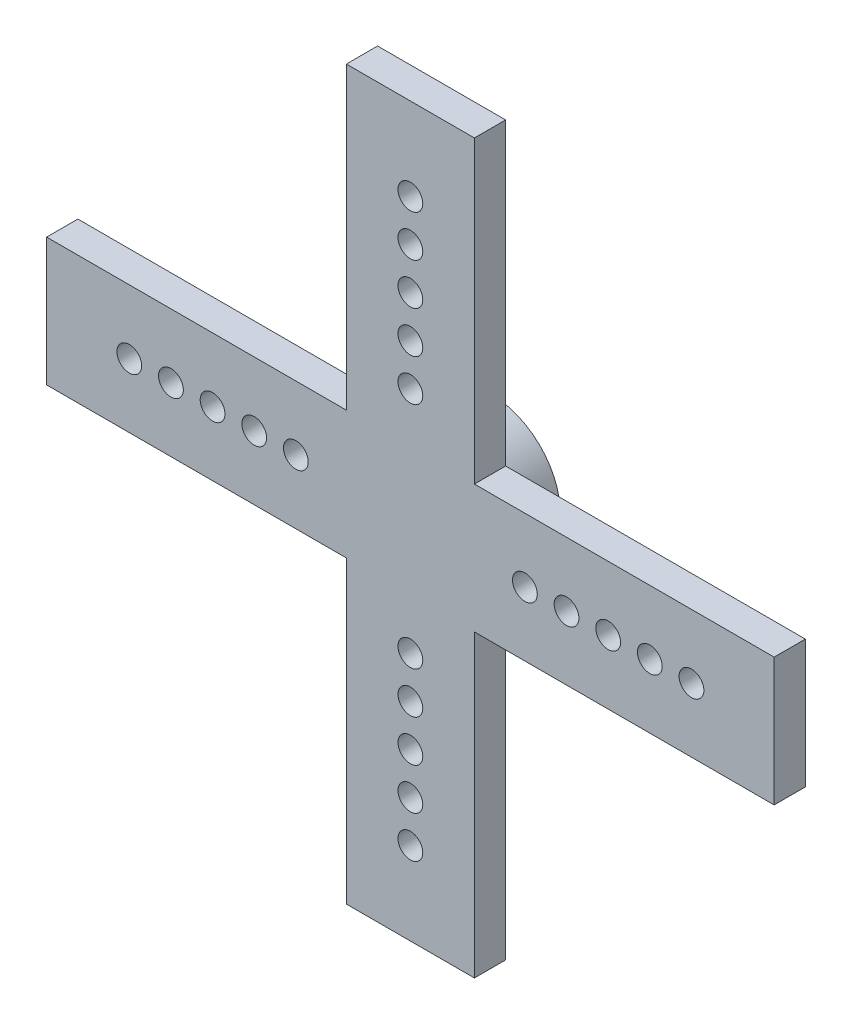
ISO-10303-21;
HEADER;
FILE_DESCRIPTION(('STEP AP214'),'2;1');
FILE_NAME('part.step','',(''),(''),'','','');
FILE_SCHEMA(('AUTOMOTIVE_DESIGN { 1 0 10303 214 1 1 1 1 }'));
ENDSEC;
DATA;
#1=APPLICATION_CONTEXT('core data for automotive mechanical design processes');
#2=APPLICATION_PROTOCOL_DEFINITION('international standard','automotive_design',2000,#1);
#3=PRODUCT_CONTEXT('',#1,'mechanical');
#4=PRODUCT('Part','Part','',(#3));
#5=PRODUCT_RELATED_PRODUCT_CATEGORY('part','',(#4));
#6=PRODUCT_DEFINITION_FORMATION('','',#4);
#7=PRODUCT_DEFINITION_CONTEXT('part definition',#1,'design');
#8=PRODUCT_DEFINITION('design','',#6,#7);
#9=PRODUCT_DEFINITION_SHAPE('','',#8);
#10=(LENGTH_UNIT() NAMED_UNIT(*) SI_UNIT(.MILLI.,.METRE.));
#11=(NAMED_UNIT(*) PLANE_ANGLE_UNIT() SI_UNIT($,.RADIAN.));
#12=(NAMED_UNIT(*) SI_UNIT($,.STERADIAN.) SOLID_ANGLE_UNIT());
#13=UNCERTAINTY_MEASURE_WITH_UNIT(LENGTH_MEASURE(1.E-05),#10,'distance_accuracy_value','');
#14=(GEOMETRIC_REPRESENTATION_CONTEXT(3) GLOBAL_UNCERTAINTY_ASSIGNED_CONTEXT((#13)) GLOBAL_UNIT_ASSIGNED_CONTEXT((#10,
#11,#12)) REPRESENTATION_CONTEXT('',''));
#15=CARTESIAN_POINT('',(0.,0.,0.));
#16=DIRECTION('',(0.,0.,1.));
#17=DIRECTION('',(1.,0.,0.));
#18=AXIS2_PLACEMENT_3D('',#15,#16,#17);
#19=CARTESIAN_POINT('',(22.1869,22.1869,1.905));
#20=DIRECTION('',(0.,0.,-1.));
#21=DIRECTION('',(-1.,0.,0.));
#22=AXIS2_PLACEMENT_3D('',#19,#20,#21);
#23=PLANE('',#22);
#24=CARTESIAN_POINT('',(1.52979343467008E-13,-14.605,1.905));
#25=DIRECTION('',(0.,0.,1.));
#26=DIRECTION('',(1.,0.,0.));
#27=AXIS2_PLACEMENT_3D('',#24,#25,#26);
#28=CIRCLE('',#27,0.755649999999999);
#29=CARTESIAN_POINT('',(0.755650000000152,-14.605,1.905));
#30=VERTEX_POINT('',#29);
#31=EDGE_CURVE('E229',#30,#30,#28,.T.);
#32=ORIENTED_EDGE('',*,*,#31,.F.);
#33=EDGE_LOOP('',(#32));
#34=FACE_BOUND('',#33,.T.);
#35=CARTESIAN_POINT('',(0.,-9.525,1.905));
#36=DIRECTION('',(0.,0.,1.));
#37=DIRECTION('',(1.,0.,0.));
#38=AXIS2_PLACEMENT_3D('',#35,#36,#37);
#39=CIRCLE('',#38,0.755649999999999);
#40=CARTESIAN_POINT('',(0.755650000000099,-9.525,1.905));
#41=VERTEX_POINT('',#40);
#42=EDGE_CURVE('E221',#41,#41,#39,.T.);
#43=ORIENTED_EDGE('',*,*,#42,.F.);
#44=EDGE_LOOP('',(#43));
#45=FACE_BOUND('',#44,.T.);
#46=CARTESIAN_POINT('',(-17.145,-1.19722964452441E-13,1.905));
#47=DIRECTION('',(0.,0.,1.));
#48=DIRECTION('',(1.,0.,0.));
#49=AXIS2_PLACEMENT_3D('',#46,#47,#48);
#50=CIRCLE('',#49,0.75565);
#51=CARTESIAN_POINT('',(-16.38935,-1.19722964452441E-13,1.905));
#52=VERTEX_POINT('',#51);
#53=EDGE_CURVE('E213',#52,#52,#50,.T.);
#54=ORIENTED_EDGE('',*,*,#53,.F.);
#55=EDGE_LOOP('',(#54));
#56=FACE_BOUND('',#55,.T.);
#57=CARTESIAN_POINT('',(-12.065,0.,1.905));
#58=DIRECTION('',(0.,0.,1.));
#59=DIRECTION('',(1.,0.,0.));
#60=AXIS2_PLACEMENT_3D('',#57,#58,#59);
#61=CIRCLE('',#60,0.75565);
#62=CARTESIAN_POINT('',(-11.30935,0.,1.905));
#63=VERTEX_POINT('',#62);
#64=EDGE_CURVE('E205',#63,#63,#61,.T.);
#65=ORIENTED_EDGE('',*,*,#64,.F.);
#66=EDGE_LOOP('',(#65));
#67=FACE_BOUND('',#66,.T.);
#68=CARTESIAN_POINT('',(-6.985,0.,1.905));
#69=DIRECTION('',(0.,0.,1.));
#70=DIRECTION('',(1.,0.,0.));
#71=AXIS2_PLACEMENT_3D('',#68,#69,#70);
#72=CIRCLE('',#71,0.755649999999999);
#73=CARTESIAN_POINT('',(-6.22935,0.,1.905));
#74=VERTEX_POINT('',#73);
#75=EDGE_CURVE('E197',#74,#74,#72,.T.);
#76=ORIENTED_EDGE('',*,*,#75,.F.);
#77=EDGE_LOOP('',(#76));
#78=FACE_BOUND('',#77,.T.);
#79=CARTESIAN_POINT('',(0.,17.145,1.905));
#80=DIRECTION('',(0.,0.,1.));
#81=DIRECTION('',(1.,0.,0.));
#82=AXIS2_PLACEMENT_3D('',#79,#80,#81);
#83=CIRCLE('',#82,0.755649999999999);
#84=CARTESIAN_POINT('',(0.755649999999939,17.145,1.905));
#85=VERTEX_POINT('',#84);
#86=EDGE_CURVE('E193',#85,#85,#83,.T.);
#87=ORIENTED_EDGE('',*,*,#86,.F.);
#88=EDGE_LOOP('',(#87));
#89=FACE_BOUND('',#88,.T.);
#90=CARTESIAN_POINT('',(0.,14.605,1.905));
#91=DIRECTION('',(0.,0.,1.));
#92=DIRECTION('',(1.,0.,0.));
#93=AXIS2_PLACEMENT_3D('',#90,#91,#92);
#94=CIRCLE('',#93,0.755649999999999);
#95=CARTESIAN_POINT('',(0.755649999999948,14.605,1.905));
#96=VERTEX_POINT('',#95);
#97=EDGE_CURVE('E189',#96,#96,#94,.T.);
#98=ORIENTED_EDGE('',*,*,#97,.F.);
#99=EDGE_LOOP('',(#98));
#100=FACE_BOUND('',#99,.T.);
#101=CARTESIAN_POINT('',(0.,12.065,1.905));
#102=DIRECTION('',(0.,0.,1.));
#103=DIRECTION('',(1.,0.,0.));
#104=AXIS2_PLACEMENT_3D('',#101,#102,#103);
#105=CIRCLE('',#104,0.755649999999999);
#106=CARTESIAN_POINT('',(0.755649999999957,12.065,1.905));
#107=VERTEX_POINT('',#106);
#108=EDGE_CURVE('E185',#107,#107,#105,.T.);
#109=ORIENTED_EDGE('',*,*,#108,.F.);
#110=EDGE_LOOP('',(#109));
#111=FACE_BOUND('',#110,.T.);
#112=DIRECTION('',(0.,1.,0.));
#113=VECTOR('',#112,1.);
#114=CARTESIAN_POINT('',(22.1869,-22.1869,1.905));
#115=LINE('',#114,#113);
#116=CARTESIAN_POINT('',(22.1869,-3.9044106638776,1.905));
#117=VERTEX_POINT('',#116);
#118=CARTESIAN_POINT('',(22.1869,3.90441066387802,1.905));
#119=VERTEX_POINT('',#118);
#120=EDGE_CURVE('E141',#117,#119,#115,.T.);
#121=ORIENTED_EDGE('',*,*,#120,.T.);
#122=DIRECTION('',(1.,0.,0.));
#123=VECTOR('',#122,1.);
#124=CARTESIAN_POINT('',(3.90441066387771,3.90441066387783,1.905));
#125=LINE('',#124,#123);
#126=CARTESIAN_POINT('',(3.90441066387771,3.90441066387783,1.905));
#127=VERTEX_POINT('',#126);
#128=EDGE_CURVE('E125',#127,#119,#125,.T.);
#129=ORIENTED_EDGE('',*,*,#128,.F.);
#130=DIRECTION('',(0.,-1.,0.));
#131=VECTOR('',#130,1.);
#132=CARTESIAN_POINT('',(3.90441066387771,3.90441066387783,1.905));
#133=LINE('',#132,#131);
#134=CARTESIAN_POINT('',(3.90441066387752,22.1869000000001,1.905));
#135=VERTEX_POINT('',#134);
#136=EDGE_CURVE('E135',#135,#127,#133,.T.);
#137=ORIENTED_EDGE('',*,*,#136,.F.);
#138=DIRECTION('',(-1.,0.,0.));
#139=VECTOR('',#138,1.);
#140=CARTESIAN_POINT('',(-22.1869,22.1869,1.905));
#141=LINE('',#140,#139);
#142=CARTESIAN_POINT('',(-3.90441066387779,22.1869,1.905));
#143=VERTEX_POINT('',#142);
#144=EDGE_CURVE('E149',#135,#143,#141,.T.);
#145=ORIENTED_EDGE('',*,*,#144,.T.);
#146=DIRECTION('',(0.,1.,0.));
#147=VECTOR('',#146,1.);
#148=CARTESIAN_POINT('',(-3.90441066387779,3.90441066387775,1.905));
#149=LINE('',#148,#147);
#150=CARTESIAN_POINT('',(-3.90441066387779,3.90441066387775,1.905));
#151=VERTEX_POINT('',#150);
#152=EDGE_CURVE('E264',#151,#143,#149,.T.);
#153=ORIENTED_EDGE('',*,*,#152,.F.);
#154=DIRECTION('',(1.,0.,0.));
#155=VECTOR('',#154,1.);
#156=CARTESIAN_POINT('',(-3.90441066387779,3.90441066387775,1.905));
#157=LINE('',#156,#155);
#158=CARTESIAN_POINT('',(-22.1869,3.90441066387775,1.905));
#159=VERTEX_POINT('',#158);
#160=EDGE_CURVE('E267',#159,#151,#157,.T.);
#161=ORIENTED_EDGE('',*,*,#160,.F.);
#162=DIRECTION('',(0.,-1.,0.));
#163=VECTOR('',#162,1.);
#164=CARTESIAN_POINT('',(-22.1869,-22.1869,1.905));
#165=LINE('',#164,#163);
#166=CARTESIAN_POINT('',(-22.1869,-3.90441066387787,1.905));
#167=VERTEX_POINT('',#166);
#168=EDGE_CURVE('E152',#159,#167,#165,.T.);
#169=ORIENTED_EDGE('',*,*,#168,.T.);
#170=DIRECTION('',(-1.,0.,0.));
#171=VECTOR('',#170,1.);
#172=CARTESIAN_POINT('',(-3.90441066387774,-3.9044106638778,1.905));
#173=LINE('',#172,#171);
#174=CARTESIAN_POINT('',(-3.90441066387774,-3.9044106638778,1.905));
#175=VERTEX_POINT('',#174);
#176=EDGE_CURVE('E247',#175,#167,#173,.T.);
#177=ORIENTED_EDGE('',*,*,#176,.F.);
#178=DIRECTION('',(0.,1.,0.));
#179=VECTOR('',#178,1.);
#180=CARTESIAN_POINT('',(-3.90441066387774,-3.9044106638778,1.905));
#181=LINE('',#180,#179);
#182=CARTESIAN_POINT('',(-3.90441066387767,-22.1869,1.905));
#183=VERTEX_POINT('',#182);
#184=EDGE_CURVE('E246',#183,#175,#181,.T.);
#185=ORIENTED_EDGE('',*,*,#184,.F.);
#186=DIRECTION('',(1.,0.,0.));
#187=VECTOR('',#186,1.);
#188=CARTESIAN_POINT('',(-22.1869,-22.1869,1.905));
#189=LINE('',#188,#187);
#190=CARTESIAN_POINT('',(3.90441066387782,-22.1869,1.905));
#191=VERTEX_POINT('',#190);
#192=EDGE_CURVE('E163',#183,#191,#189,.T.);
#193=ORIENTED_EDGE('',*,*,#192,.T.);
#194=DIRECTION('',(0.,-1.,0.));
#195=VECTOR('',#194,1.);
#196=CARTESIAN_POINT('',(3.90441066387782,-3.90441066387772,1.905));
#197=LINE('',#196,#195);
#198=CARTESIAN_POINT('',(3.90441066387782,-3.90441066387772,1.905));
#199=VERTEX_POINT('',#198);
#200=EDGE_CURVE('E59',#199,#191,#197,.T.);
#201=ORIENTED_EDGE('',*,*,#200,.F.);
#202=DIRECTION('',(-1.,0.,0.));
#203=VECTOR('',#202,1.);
#204=CARTESIAN_POINT('',(3.90441066387782,-3.90441066387772,1.905));
#205=LINE('',#204,#203);
#206=EDGE_CURVE('E148',#117,#199,#205,.T.);
#207=ORIENTED_EDGE('',*,*,#206,.F.);
#208=EDGE_LOOP('',(#121,#129,#137,#145,#153,#161,#169,#177,#185,#193,#201,#207));
#209=FACE_BOUND('',#208,.T.);
#210=CARTESIAN_POINT('',(6.985,0.,1.905));
#211=DIRECTION('',(0.,0.,1.));
#212=DIRECTION('',(1.,0.,0.));
#213=AXIS2_PLACEMENT_3D('',#210,#211,#212);
#214=CIRCLE('',#213,0.755649999999999);
#215=CARTESIAN_POINT('',(7.74065,0.,1.905));
#216=VERTEX_POINT('',#215);
#217=EDGE_CURVE('E180',#216,#216,#214,.T.);
#218=ORIENTED_EDGE('',*,*,#217,.F.);
#219=EDGE_LOOP('',(#218));
#220=FACE_BOUND('',#219,.T.);
#221=CARTESIAN_POINT('',(9.525,0.,1.905));
#222=DIRECTION('',(0.,0.,1.));
#223=DIRECTION('',(1.,0.,0.));
#224=AXIS2_PLACEMENT_3D('',#221,#222,#223);
#225=CIRCLE('',#224,0.75565);
#226=CARTESIAN_POINT('',(10.28065,0.,1.905));
#227=VERTEX_POINT('',#226);
#228=EDGE_CURVE('E334',#227,#227,#225,.T.);
#229=ORIENTED_EDGE('',*,*,#228,.F.);
#230=EDGE_LOOP('',(#229));
#231=FACE_BOUND('',#230,.T.);
#232=CARTESIAN_POINT('',(12.065,0.,1.905));
#233=DIRECTION('',(0.,0.,1.));
#234=DIRECTION('',(1.,0.,0.));
#235=AXIS2_PLACEMENT_3D('',#232,#233,#234);
#236=CIRCLE('',#235,0.75565);
#237=CARTESIAN_POINT('',(12.82065,0.,1.905));
#238=VERTEX_POINT('',#237);
#239=EDGE_CURVE('E328',#238,#238,#236,.T.);
#240=ORIENTED_EDGE('',*,*,#239,.F.);
#241=EDGE_LOOP('',(#240));
#242=FACE_BOUND('',#241,.T.);
#243=CARTESIAN_POINT('',(14.605,0.,1.905));
#244=DIRECTION('',(0.,0.,1.));
#245=DIRECTION('',(1.,0.,0.));
#246=AXIS2_PLACEMENT_3D('',#243,#244,#245);
#247=CIRCLE('',#246,0.75565);
#248=CARTESIAN_POINT('',(15.36065,0.,1.905));
#249=VERTEX_POINT('',#248);
#250=EDGE_CURVE('E322',#249,#249,#247,.T.);
#251=ORIENTED_EDGE('',*,*,#250,.F.);
#252=EDGE_LOOP('',(#251));
#253=FACE_BOUND('',#252,.T.);
#254=CARTESIAN_POINT('',(17.145,0.,1.905));
#255=DIRECTION('',(0.,0.,1.));
#256=DIRECTION('',(1.,0.,0.));
#257=AXIS2_PLACEMENT_3D('',#254,#255,#256);
#258=CIRCLE('',#257,0.75565);
#259=CARTESIAN_POINT('',(17.90065,0.,1.905));
#260=VERTEX_POINT('',#259);
#261=EDGE_CURVE('E316',#260,#260,#258,.T.);
#262=ORIENTED_EDGE('',*,*,#261,.F.);
#263=EDGE_LOOP('',(#262));
#264=FACE_BOUND('',#263,.T.);
#265=CARTESIAN_POINT('',(0.,6.985,1.905));
#266=DIRECTION('',(0.,0.,1.));
#267=DIRECTION('',(1.,0.,0.));
#268=AXIS2_PLACEMENT_3D('',#265,#266,#267);
#269=CIRCLE('',#268,0.755649999999999);
#270=CARTESIAN_POINT('',(0.755649999999975,6.985,1.905));
#271=VERTEX_POINT('',#270);
#272=EDGE_CURVE('E310',#271,#271,#269,.T.);
#273=ORIENTED_EDGE('',*,*,#272,.F.);
#274=EDGE_LOOP('',(#273));
#275=FACE_BOUND('',#274,.T.);
#276=CARTESIAN_POINT('',(0.,9.525,1.905));
#277=DIRECTION('',(0.,0.,1.));
#278=DIRECTION('',(1.,0.,0.));
#279=AXIS2_PLACEMENT_3D('',#276,#277,#278);
#280=CIRCLE('',#279,0.755649999999999);
#281=CARTESIAN_POINT('',(0.755649999999966,9.525,1.905));
#282=VERTEX_POINT('',#281);
#283=EDGE_CURVE('E184',#282,#282,#280,.T.);
#284=ORIENTED_EDGE('',*,*,#283,.F.);
#285=EDGE_LOOP('',(#284));
#286=FACE_BOUND('',#285,.T.);
#287=CARTESIAN_POINT('',(-9.525,0.,1.905));
#288=DIRECTION('',(0.,0.,1.));
#289=DIRECTION('',(1.,0.,0.));
#290=AXIS2_PLACEMENT_3D('',#287,#288,#289);
#291=CIRCLE('',#290,0.75565);
#292=CARTESIAN_POINT('',(-8.76935,0.,1.905));
#293=VERTEX_POINT('',#292);
#294=EDGE_CURVE('E201',#293,#293,#291,.T.);
#295=ORIENTED_EDGE('',*,*,#294,.F.);
#296=EDGE_LOOP('',(#295));
#297=FACE_BOUND('',#296,.T.);
#298=CARTESIAN_POINT('',(-14.605,-1.01986228978005E-13,1.905));
#299=DIRECTION('',(0.,0.,1.));
#300=DIRECTION('',(1.,0.,0.));
#301=AXIS2_PLACEMENT_3D('',#298,#299,#300);
#302=CIRCLE('',#301,0.75565);
#303=CARTESIAN_POINT('',(-13.84935,-1.01986228978005E-13,1.905));
#304=VERTEX_POINT('',#303);
#305=EDGE_CURVE('E209',#304,#304,#302,.T.);
#306=ORIENTED_EDGE('',*,*,#305,.F.);
#307=EDGE_LOOP('',(#306));
#308=FACE_BOUND('',#307,.T.);
#309=CARTESIAN_POINT('',(0.,-6.985,1.905));
#310=DIRECTION('',(0.,0.,1.));
#311=DIRECTION('',(1.,0.,0.));
#312=AXIS2_PLACEMENT_3D('',#309,#310,#311);
#313=CIRCLE('',#312,0.755649999999999);
#314=CARTESIAN_POINT('',(0.755650000000073,-6.985,1.905));
#315=VERTEX_POINT('',#314);
#316=EDGE_CURVE('E217',#315,#315,#313,.T.);
#317=ORIENTED_EDGE('',*,*,#316,.F.);
#318=EDGE_LOOP('',(#317));
#319=FACE_BOUND('',#318,.T.);
#320=CARTESIAN_POINT('',(1.26374240255354E-13,-12.065,1.905));
#321=DIRECTION('',(0.,0.,1.));
#322=DIRECTION('',(1.,0.,0.));
#323=AXIS2_PLACEMENT_3D('',#320,#321,#322);
#324=CIRCLE('',#323,0.755649999999999);
#325=CARTESIAN_POINT('',(0.755650000000126,-12.065,1.905));
#326=VERTEX_POINT('',#325);
#327=EDGE_CURVE('E225',#326,#326,#324,.T.);
#328=ORIENTED_EDGE('',*,*,#327,.F.);
#329=EDGE_LOOP('',(#328));
#330=FACE_BOUND('',#329,.T.);
#331=CARTESIAN_POINT('',(1.79584446678661E-13,-17.145,1.905));
#332=DIRECTION('',(0.,0.,1.));
#333=DIRECTION('',(1.,0.,0.));
#334=AXIS2_PLACEMENT_3D('',#331,#332,#333);
#335=CIRCLE('',#334,0.755649999999999);
#336=CARTESIAN_POINT('',(0.755650000000179,-17.145,1.905));
#337=VERTEX_POINT('',#336);
#338=EDGE_CURVE('E233',#337,#337,#335,.T.);
#339=ORIENTED_EDGE('',*,*,#338,.F.);
#340=EDGE_LOOP('',(#339));
#341=FACE_BOUND('',#340,.T.);
#342=ADVANCED_FACE('F37',(#34,#45,#56,#67,#78,#89,#100,#111,#209,#220,#231,#242,#253,#264,#275,
#286,#297,#308,#319,#330,#341),#23,.F.);
#343=CARTESIAN_POINT('',(22.1869,22.1869,0.));
#344=DIRECTION('',(0.,0.,-1.));
#345=DIRECTION('',(-1.,0.,0.));
#346=AXIS2_PLACEMENT_3D('',#343,#344,#345);
#347=PLANE('',#346);
#348=DIRECTION('',(-1.,0.,0.));
#349=VECTOR('',#348,1.);
#350=CARTESIAN_POINT('',(22.1869000000002,3.90441066387802,0.));
#351=LINE('',#350,#349);
#352=CARTESIAN_POINT('',(22.1869,3.90441066387802,0.));
#353=VERTEX_POINT('',#352);
#354=CARTESIAN_POINT('',(3.90441066387771,3.90441066387783,0.));
#355=VERTEX_POINT('',#354);
#356=EDGE_CURVE('E688',#353,#355,#351,.T.);
#357=ORIENTED_EDGE('',*,*,#356,.F.);
#358=DIRECTION('',(0.,1.,0.));
#359=VECTOR('',#358,1.);
#360=CARTESIAN_POINT('',(22.1869,-22.1869,0.));
#361=LINE('',#360,#359);
#362=CARTESIAN_POINT('',(22.1869,-3.9044106638776,0.));
#363=VERTEX_POINT('',#362);
#364=EDGE_CURVE('E143',#363,#353,#361,.T.);
#365=ORIENTED_EDGE('',*,*,#364,.F.);
#366=DIRECTION('',(1.,0.,0.));
#367=VECTOR('',#366,1.);
#368=CARTESIAN_POINT('',(22.1869000000002,-3.9044106638776,0.));
#369=LINE('',#368,#367);
#370=CARTESIAN_POINT('',(3.90441066387782,-3.90441066387772,0.));
#371=VERTEX_POINT('',#370);
#372=EDGE_CURVE('E255',#371,#363,#369,.T.);
#373=ORIENTED_EDGE('',*,*,#372,.F.);
#374=DIRECTION('',(0.,1.,0.));
#375=VECTOR('',#374,1.);
#376=CARTESIAN_POINT('',(3.90441066387764,22.1868999999999,0.));
#377=LINE('',#376,#375);
#378=CARTESIAN_POINT('',(3.90441066387795,-22.1869,0.));
#379=VERTEX_POINT('',#378);
#380=EDGE_CURVE('E686',#379,#371,#377,.T.);
#381=ORIENTED_EDGE('',*,*,#380,.F.);
#382=DIRECTION('',(1.,0.,0.));
#383=VECTOR('',#382,1.);
#384=CARTESIAN_POINT('',(-22.1869,-22.1869,0.));
#385=LINE('',#384,#383);
#386=CARTESIAN_POINT('',(-3.90441066387767,-22.1869,0.));
#387=VERTEX_POINT('',#386);
#388=EDGE_CURVE('E150',#387,#379,#385,.T.);
#389=ORIENTED_EDGE('',*,*,#388,.F.);
#390=DIRECTION('',(0.,-1.,0.));
#391=VECTOR('',#390,1.);
#392=CARTESIAN_POINT('',(-3.90441066387783,22.1868999999999,0.));
#393=LINE('',#392,#391);
#394=CARTESIAN_POINT('',(-3.90441066387774,-3.9044106638778,0.));
#395=VERTEX_POINT('',#394);
#396=EDGE_CURVE('E259',#395,#387,#393,.T.);
#397=ORIENTED_EDGE('',*,*,#396,.F.);
#398=DIRECTION('',(1.,0.,0.));
#399=VECTOR('',#398,1.);
#400=CARTESIAN_POINT('',(22.1869000000001,-3.90441066387771,0.));
#401=LINE('',#400,#399);
#402=CARTESIAN_POINT('',(-22.1869,-3.90441066387787,0.));
#403=VERTEX_POINT('',#402);
#404=EDGE_CURVE('E262',#403,#395,#401,.T.);
#405=ORIENTED_EDGE('',*,*,#404,.F.);
#406=DIRECTION('',(0.,-1.,0.));
#407=VECTOR('',#406,1.);
#408=CARTESIAN_POINT('',(-22.1869,-22.1869,0.));
#409=LINE('',#408,#407);
#410=CARTESIAN_POINT('',(-22.1869,3.90441066387775,0.));
#411=VERTEX_POINT('',#410);
#412=EDGE_CURVE('E155',#411,#403,#409,.T.);
#413=ORIENTED_EDGE('',*,*,#412,.F.);
#414=DIRECTION('',(-1.,0.,0.));
#415=VECTOR('',#414,1.);
#416=CARTESIAN_POINT('',(22.1869,3.90441066387775,0.));
#417=LINE('',#416,#415);
#418=CARTESIAN_POINT('',(-3.90441066387779,3.90441066387775,0.));
#419=VERTEX_POINT('',#418);
#420=EDGE_CURVE('E273',#419,#411,#417,.T.);
#421=ORIENTED_EDGE('',*,*,#420,.F.);
#422=DIRECTION('',(0.,-1.,0.));
#423=VECTOR('',#422,1.);
#424=CARTESIAN_POINT('',(-3.90441066387779,22.1869,0.));
#425=LINE('',#424,#423);
#426=CARTESIAN_POINT('',(-3.90441066387779,22.1869,0.));
#427=VERTEX_POINT('',#426);
#428=EDGE_CURVE('E277',#427,#419,#425,.T.);
#429=ORIENTED_EDGE('',*,*,#428,.F.);
#430=DIRECTION('',(-1.,0.,0.));
#431=VECTOR('',#430,1.);
#432=CARTESIAN_POINT('',(-22.1869,22.1869,0.));
#433=LINE('',#432,#431);
#434=CARTESIAN_POINT('',(3.90441066387752,22.1869,0.));
#435=VERTEX_POINT('',#434);
#436=EDGE_CURVE('E168',#435,#427,#433,.T.);
#437=ORIENTED_EDGE('',*,*,#436,.F.);
#438=DIRECTION('',(0.,1.,0.));
#439=VECTOR('',#438,1.);
#440=CARTESIAN_POINT('',(3.90441066387752,22.1868999999998,0.));
#441=LINE('',#440,#439);
#442=EDGE_CURVE('E52',#355,#435,#441,.T.);
#443=ORIENTED_EDGE('',*,*,#442,.F.);
#444=EDGE_LOOP('',(#357,#365,#373,#381,#389,#397,#405,#413,#421,#429,#437,#443));
#445=FACE_BOUND('',#444,.T.);
#446=CARTESIAN_POINT('',(1.79584446678661E-13,-17.145,0.));
#447=DIRECTION('',(0.,0.,-1.));
#448=DIRECTION('',(-1.,0.,0.));
#449=AXIS2_PLACEMENT_3D('',#446,#447,#448);
#450=CIRCLE('',#449,0.755649999999999);
#451=CARTESIAN_POINT('',(-0.755649999999819,-17.145,0.));
#452=VERTEX_POINT('',#451);
#453=EDGE_CURVE('E230',#452,#452,#450,.T.);
#454=ORIENTED_EDGE('',*,*,#453,.F.);
#455=EDGE_LOOP('',(#454));
#456=FACE_BOUND('',#455,.T.);
#457=CARTESIAN_POINT('',(1.52979343467008E-13,-14.605,0.));
#458=DIRECTION('',(0.,0.,-1.));
#459=DIRECTION('',(-1.,0.,0.));
#460=AXIS2_PLACEMENT_3D('',#457,#458,#459);
#461=CIRCLE('',#460,0.755649999999999);
#462=CARTESIAN_POINT('',(-0.755649999999846,-14.605,0.));
#463=VERTEX_POINT('',#462);
#464=EDGE_CURVE('E226',#463,#463,#461,.T.);
#465=ORIENTED_EDGE('',*,*,#464,.F.);
#466=EDGE_LOOP('',(#465));
#467=FACE_BOUND('',#466,.T.);
#468=CARTESIAN_POINT('',(1.26374240255354E-13,-12.065,0.));
#469=DIRECTION('',(0.,0.,-1.));
#470=DIRECTION('',(-1.,0.,0.));
#471=AXIS2_PLACEMENT_3D('',#468,#469,#470);
#472=CIRCLE('',#471,0.755649999999999);
#473=CARTESIAN_POINT('',(-0.755649999999873,-12.065,0.));
#474=VERTEX_POINT('',#473);
#475=EDGE_CURVE('E222',#474,#474,#472,.T.);
#476=ORIENTED_EDGE('',*,*,#475,.F.);
#477=EDGE_LOOP('',(#476));
#478=FACE_BOUND('',#477,.T.);
#479=CARTESIAN_POINT('',(0.,-9.525,0.));
#480=DIRECTION('',(0.,0.,-1.));
#481=DIRECTION('',(-1.,0.,0.));
#482=AXIS2_PLACEMENT_3D('',#479,#480,#481);
#483=CIRCLE('',#482,0.755649999999999);
#484=CARTESIAN_POINT('',(-0.755649999999899,-9.525,0.));
#485=VERTEX_POINT('',#484);
#486=EDGE_CURVE('E218',#485,#485,#483,.T.);
#487=ORIENTED_EDGE('',*,*,#486,.F.);
#488=EDGE_LOOP('',(#487));
#489=FACE_BOUND('',#488,.T.);
#490=CARTESIAN_POINT('',(0.,-6.985,0.));
#491=DIRECTION('',(0.,0.,-1.));
#492=DIRECTION('',(-1.,0.,0.));
#493=AXIS2_PLACEMENT_3D('',#490,#491,#492);
#494=CIRCLE('',#493,0.755649999999999);
#495=CARTESIAN_POINT('',(-0.755649999999926,-6.985,0.));
#496=VERTEX_POINT('',#495);
#497=EDGE_CURVE('E214',#496,#496,#494,.T.);
#498=ORIENTED_EDGE('',*,*,#497,.F.);
#499=EDGE_LOOP('',(#498));
#500=FACE_BOUND('',#499,.T.);
#501=CARTESIAN_POINT('',(-17.145,-1.19722964452441E-13,0.));
#502=DIRECTION('',(0.,0.,-1.));
#503=DIRECTION('',(-1.,0.,0.));
#504=AXIS2_PLACEMENT_3D('',#501,#502,#503);
#505=CIRCLE('',#504,0.75565);
#506=CARTESIAN_POINT('',(-17.90065,-1.19722964452441E-13,0.));
#507=VERTEX_POINT('',#506);
#508=EDGE_CURVE('E210',#507,#507,#505,.T.);
#509=ORIENTED_EDGE('',*,*,#508,.F.);
#510=EDGE_LOOP('',(#509));
#511=FACE_BOUND('',#510,.T.);
#512=CARTESIAN_POINT('',(-14.605,-1.01986228978005E-13,0.));
#513=DIRECTION('',(0.,0.,-1.));
#514=DIRECTION('',(-1.,0.,0.));
#515=AXIS2_PLACEMENT_3D('',#512,#513,#514);
#516=CIRCLE('',#515,0.755649999999999);
#517=CARTESIAN_POINT('',(-15.36065,-1.01986228978005E-13,0.));
#518=VERTEX_POINT('',#517);
#519=EDGE_CURVE('E206',#518,#518,#516,.T.);
#520=ORIENTED_EDGE('',*,*,#519,.F.);
#521=EDGE_LOOP('',(#520));
#522=FACE_BOUND('',#521,.T.);
#523=CARTESIAN_POINT('',(-12.065,0.,0.));
#524=DIRECTION('',(0.,0.,-1.));
#525=DIRECTION('',(-1.,0.,0.));
#526=AXIS2_PLACEMENT_3D('',#523,#524,#525);
#527=CIRCLE('',#526,0.755649999999999);
#528=CARTESIAN_POINT('',(-12.82065,0.,0.));
#529=VERTEX_POINT('',#528);
#530=EDGE_CURVE('E202',#529,#529,#527,.T.);
#531=ORIENTED_EDGE('',*,*,#530,.F.);
#532=EDGE_LOOP('',(#531));
#533=FACE_BOUND('',#532,.T.);
#534=CARTESIAN_POINT('',(-9.525,0.,0.));
#535=DIRECTION('',(0.,0.,-1.));
#536=DIRECTION('',(-1.,0.,0.));
#537=AXIS2_PLACEMENT_3D('',#534,#535,#536);
#538=CIRCLE('',#537,0.755649999999999);
#539=CARTESIAN_POINT('',(-10.28065,0.,0.));
#540=VERTEX_POINT('',#539);
#541=EDGE_CURVE('E198',#540,#540,#538,.T.);
#542=ORIENTED_EDGE('',*,*,#541,.F.);
#543=EDGE_LOOP('',(#542));
#544=FACE_BOUND('',#543,.T.);
#545=CARTESIAN_POINT('',(-6.985,0.,0.));
#546=DIRECTION('',(0.,0.,-1.));
#547=DIRECTION('',(-1.,0.,0.));
#548=AXIS2_PLACEMENT_3D('',#545,#546,#547);
#549=CIRCLE('',#548,0.755649999999999);
#550=CARTESIAN_POINT('',(-7.74065,0.,0.));
#551=VERTEX_POINT('',#550);
#552=EDGE_CURVE('E194',#551,#551,#549,.T.);
#553=ORIENTED_EDGE('',*,*,#552,.F.);
#554=EDGE_LOOP('',(#553));
#555=FACE_BOUND('',#554,.T.);
#556=CARTESIAN_POINT('',(0.,17.145,0.));
#557=DIRECTION('',(0.,0.,-1.));
#558=DIRECTION('',(-1.,0.,0.));
#559=AXIS2_PLACEMENT_3D('',#556,#557,#558);
#560=CIRCLE('',#559,0.755649999999999);
#561=CARTESIAN_POINT('',(-0.755650000000059,17.145,0.));
#562=VERTEX_POINT('',#561);
#563=EDGE_CURVE('E190',#562,#562,#560,.T.);
#564=ORIENTED_EDGE('',*,*,#563,.F.);
#565=EDGE_LOOP('',(#564));
#566=FACE_BOUND('',#565,.T.);
#567=CARTESIAN_POINT('',(0.,14.605,0.));
#568=DIRECTION('',(0.,0.,-1.));
#569=DIRECTION('',(-1.,0.,0.));
#570=AXIS2_PLACEMENT_3D('',#567,#568,#569);
#571=CIRCLE('',#570,0.755649999999999);
#572=CARTESIAN_POINT('',(-0.75565000000005,14.605,0.));
#573=VERTEX_POINT('',#572);
#574=EDGE_CURVE('E186',#573,#573,#571,.T.);
#575=ORIENTED_EDGE('',*,*,#574,.F.);
#576=EDGE_LOOP('',(#575));
#577=FACE_BOUND('',#576,.T.);
#578=CARTESIAN_POINT('',(0.,12.065,0.));
#579=DIRECTION('',(0.,0.,-1.));
#580=DIRECTION('',(-1.,0.,0.));
#581=AXIS2_PLACEMENT_3D('',#578,#579,#580);
#582=CIRCLE('',#581,0.755649999999999);
#583=CARTESIAN_POINT('',(-0.755650000000041,12.065,0.));
#584=VERTEX_POINT('',#583);
#585=EDGE_CURVE('E181',#584,#584,#582,.T.);
#586=ORIENTED_EDGE('',*,*,#585,.F.);
#587=EDGE_LOOP('',(#586));
#588=FACE_BOUND('',#587,.T.);
#589=CARTESIAN_POINT('',(0.,9.525,0.));
#590=DIRECTION('',(0.,0.,-1.));
#591=DIRECTION('',(-1.,0.,0.));
#592=AXIS2_PLACEMENT_3D('',#589,#590,#591);
#593=CIRCLE('',#592,0.755649999999999);
#594=CARTESIAN_POINT('',(-0.755650000000032,9.525,0.));
#595=VERTEX_POINT('',#594);
#596=EDGE_CURVE('E307',#595,#595,#593,.T.);
#597=ORIENTED_EDGE('',*,*,#596,.F.);
#598=EDGE_LOOP('',(#597));
#599=FACE_BOUND('',#598,.T.);
#600=CARTESIAN_POINT('',(0.,6.985,0.));
#601=DIRECTION('',(0.,0.,-1.));
#602=DIRECTION('',(-1.,0.,0.));
#603=AXIS2_PLACEMENT_3D('',#600,#601,#602);
#604=CIRCLE('',#603,0.755649999999999);
#605=CARTESIAN_POINT('',(-0.755650000000023,6.985,0.));
#606=VERTEX_POINT('',#605);
#607=EDGE_CURVE('E313',#606,#606,#604,.T.);
#608=ORIENTED_EDGE('',*,*,#607,.F.);
#609=EDGE_LOOP('',(#608));
#610=FACE_BOUND('',#609,.T.);
#611=CARTESIAN_POINT('',(17.145,0.,0.));
#612=DIRECTION('',(0.,0.,-1.));
#613=DIRECTION('',(-1.,0.,0.));
#614=AXIS2_PLACEMENT_3D('',#611,#612,#613);
#615=CIRCLE('',#614,0.75565);
#616=CARTESIAN_POINT('',(16.38935,0.,0.));
#617=VERTEX_POINT('',#616);
#618=EDGE_CURVE('E319',#617,#617,#615,.T.);
#619=ORIENTED_EDGE('',*,*,#618,.F.);
#620=EDGE_LOOP('',(#619));
#621=FACE_BOUND('',#620,.T.);
#622=CARTESIAN_POINT('',(14.605,0.,0.));
#623=DIRECTION('',(0.,0.,-1.));
#624=DIRECTION('',(-1.,0.,0.));
#625=AXIS2_PLACEMENT_3D('',#622,#623,#624);
#626=CIRCLE('',#625,0.755649999999999);
#627=CARTESIAN_POINT('',(13.84935,0.,0.));
#628=VERTEX_POINT('',#627);
#629=EDGE_CURVE('E325',#628,#628,#626,.T.);
#630=ORIENTED_EDGE('',*,*,#629,.F.);
#631=EDGE_LOOP('',(#630));
#632=FACE_BOUND('',#631,.T.);
#633=CARTESIAN_POINT('',(12.065,0.,0.));
#634=DIRECTION('',(0.,0.,-1.));
#635=DIRECTION('',(-1.,0.,0.));
#636=AXIS2_PLACEMENT_3D('',#633,#634,#635);
#637=CIRCLE('',#636,0.755649999999999);
#638=CARTESIAN_POINT('',(11.30935,0.,0.));
#639=VERTEX_POINT('',#638);
#640=EDGE_CURVE('E331',#639,#639,#637,.T.);
#641=ORIENTED_EDGE('',*,*,#640,.F.);
#642=EDGE_LOOP('',(#641));
#643=FACE_BOUND('',#642,.T.);
#644=CARTESIAN_POINT('',(9.525,0.,0.));
#645=DIRECTION('',(0.,0.,-1.));
#646=DIRECTION('',(-1.,0.,0.));
#647=AXIS2_PLACEMENT_3D('',#644,#645,#646);
#648=CIRCLE('',#647,0.755649999999999);
#649=CARTESIAN_POINT('',(8.76935,0.,0.));
#650=VERTEX_POINT('',#649);
#651=EDGE_CURVE('E337',#650,#650,#648,.T.);
#652=ORIENTED_EDGE('',*,*,#651,.F.);
#653=EDGE_LOOP('',(#652));
#654=FACE_BOUND('',#653,.T.);
#655=CARTESIAN_POINT('',(6.985,0.,0.));
#656=DIRECTION('',(0.,0.,-1.));
#657=DIRECTION('',(-1.,0.,0.));
#658=AXIS2_PLACEMENT_3D('',#655,#656,#657);
#659=CIRCLE('',#658,0.755649999999999);
#660=CARTESIAN_POINT('',(6.22935,0.,0.));
#661=VERTEX_POINT('',#660);
#662=EDGE_CURVE('E176',#661,#661,#659,.T.);
#663=ORIENTED_EDGE('',*,*,#662,.F.);
#664=EDGE_LOOP('',(#663));
#665=FACE_BOUND('',#664,.T.);
#666=CARTESIAN_POINT('',(0.,0.,0.));
#667=DIRECTION('',(0.,0.,-1.));
#668=DIRECTION('',(-1.,0.,0.));
#669=AXIS2_PLACEMENT_3D('',#666,#667,#668);
#670=CIRCLE('',#669,4.2291);
#671=CARTESIAN_POINT('',(-4.2291,0.,0.));
#672=VERTEX_POINT('',#671);
#673=EDGE_CURVE('E158',#672,#672,#670,.T.);
#674=ORIENTED_EDGE('',*,*,#673,.F.);
#675=EDGE_LOOP('',(#674));
#676=FACE_BOUND('',#675,.T.);
#677=ADVANCED_FACE('F351',(#445,#456,#467,#478,#489,#500,#511,#522,#533,#544,#555,#566,#577,
#588,#599,#610,#621,#632,#643,#654,#665,#676),#347,.T.);
#678=CARTESIAN_POINT('',(22.1869,-22.1869,1.905));
#679=DIRECTION('',(-1.,0.,0.));
#680=DIRECTION('',(0.,0.,1.));
#681=AXIS2_PLACEMENT_3D('',#678,#679,#680);
#682=PLANE('',#681);
#683=ORIENTED_EDGE('',*,*,#364,.T.);
#684=DIRECTION('',(0.,0.,1.));
#685=VECTOR('',#684,1.);
#686=CARTESIAN_POINT('',(22.1869,3.90441066387802,-3.0226));
#687=LINE('',#686,#685);
#688=EDGE_CURVE('E128',#353,#119,#687,.T.);
#689=ORIENTED_EDGE('',*,*,#688,.T.);
#690=ORIENTED_EDGE('',*,*,#120,.F.);
#691=DIRECTION('',(0.,0.,1.));
#692=VECTOR('',#691,1.);
#693=CARTESIAN_POINT('',(22.1869,-3.9044106638776,-3.0226));
#694=LINE('',#693,#692);
#695=EDGE_CURVE('E684',#363,#117,#694,.T.);
#696=ORIENTED_EDGE('',*,*,#695,.F.);
#697=EDGE_LOOP('',(#683,#689,#690,#696));
#698=FACE_BOUND('',#697,.T.);
#699=ADVANCED_FACE('F39',(#698),#682,.F.);
#700=CARTESIAN_POINT('',(-22.1869,22.1869,1.905));
#701=DIRECTION('',(0.,-1.,0.));
#702=DIRECTION('',(0.,0.,-1.));
#703=AXIS2_PLACEMENT_3D('',#700,#701,#702);
#704=PLANE('',#703);
#705=ORIENTED_EDGE('',*,*,#144,.F.);
#706=DIRECTION('',(0.,0.,-1.));
#707=VECTOR('',#706,1.);
#708=CARTESIAN_POINT('',(3.90441066387752,22.1869,1.905));
#709=LINE('',#708,#707);
#710=EDGE_CURVE('E11',#135,#435,#709,.T.);
#711=ORIENTED_EDGE('',*,*,#710,.T.);
#712=ORIENTED_EDGE('',*,*,#436,.T.);
#713=DIRECTION('',(0.,0.,1.));
#714=VECTOR('',#713,1.);
#715=CARTESIAN_POINT('',(-3.90441066387779,22.1869,-3.0226));
#716=LINE('',#715,#714);
#717=EDGE_CURVE('E270',#427,#143,#716,.T.);
#718=ORIENTED_EDGE('',*,*,#717,.T.);
#719=EDGE_LOOP('',(#705,#711,#712,#718));
#720=FACE_BOUND('',#719,.T.);
#721=ADVANCED_FACE('F360',(#720),#704,.F.);
#722=CARTESIAN_POINT('',(-22.1869,-22.1869,1.905));
#723=DIRECTION('',(1.,0.,0.));
#724=DIRECTION('',(0.,0.,-1.));
#725=AXIS2_PLACEMENT_3D('',#722,#723,#724);
#726=PLANE('',#725);
#727=ORIENTED_EDGE('',*,*,#412,.T.);
#728=DIRECTION('',(0.,0.,1.));
#729=VECTOR('',#728,1.);
#730=CARTESIAN_POINT('',(-22.1869,-3.90441066387787,-3.0226));
#731=LINE('',#730,#729);
#732=EDGE_CURVE('E250',#403,#167,#731,.T.);
#733=ORIENTED_EDGE('',*,*,#732,.T.);
#734=ORIENTED_EDGE('',*,*,#168,.F.);
#735=DIRECTION('',(0.,0.,-1.));
#736=VECTOR('',#735,1.);
#737=CARTESIAN_POINT('',(-22.1869,3.90441066387775,1.905));
#738=LINE('',#737,#736);
#739=EDGE_CURVE('E175',#159,#411,#738,.T.);
#740=ORIENTED_EDGE('',*,*,#739,.T.);
#741=EDGE_LOOP('',(#727,#733,#734,#740));
#742=FACE_BOUND('',#741,.T.);
#743=ADVANCED_FACE('F392',(#742),#726,.F.);
#744=CARTESIAN_POINT('',(-22.1869,-22.1869,1.905));
#745=DIRECTION('',(0.,1.,0.));
#746=DIRECTION('',(0.,0.,1.));
#747=AXIS2_PLACEMENT_3D('',#744,#745,#746);
#748=PLANE('',#747);
#749=ORIENTED_EDGE('',*,*,#388,.T.);
#750=DIRECTION('',(0.,0.,1.));
#751=VECTOR('',#750,1.);
#752=CARTESIAN_POINT('',(3.90441066387795,-22.1869,1.905));
#753=LINE('',#752,#751);
#754=EDGE_CURVE('E45',#379,#191,#753,.T.);
#755=ORIENTED_EDGE('',*,*,#754,.T.);
#756=ORIENTED_EDGE('',*,*,#192,.F.);
#757=DIRECTION('',(0.,0.,-1.));
#758=VECTOR('',#757,1.);
#759=CARTESIAN_POINT('',(-3.90441066387767,-22.1869,1.905));
#760=LINE('',#759,#758);
#761=EDGE_CURVE('E236',#183,#387,#760,.T.);
#762=ORIENTED_EDGE('',*,*,#761,.T.);
#763=EDGE_LOOP('',(#749,#755,#756,#762));
#764=FACE_BOUND('',#763,.T.);
#765=ADVANCED_FACE('F240',(#764),#748,.F.);
#766=CARTESIAN_POINT('',(0.,0.,-3.0226));
#767=DIRECTION('',(0.,0.,-1.));
#768=DIRECTION('',(-1.,0.,0.));
#769=AXIS2_PLACEMENT_3D('',#766,#767,#768);
#770=PLANE('',#769);
#771=CARTESIAN_POINT('',(0.,0.,-3.0226));
#772=DIRECTION('',(0.,0.,-1.));
#773=DIRECTION('',(-1.,0.,0.));
#774=AXIS2_PLACEMENT_3D('',#771,#772,#773);
#775=CIRCLE('',#774,4.2291);
#776=CARTESIAN_POINT('',(-4.2291,0.,-3.0226));
#777=VERTEX_POINT('',#776);
#778=EDGE_CURVE('E169',#777,#777,#775,.T.);
#779=ORIENTED_EDGE('',*,*,#778,.T.);
#780=EDGE_LOOP('',(#779));
#781=FACE_BOUND('',#780,.T.);
#782=CARTESIAN_POINT('',(0.,0.,-3.0226));
#783=DIRECTION('',(0.,0.,-1.));
#784=DIRECTION('',(-1.,0.,0.));
#785=AXIS2_PLACEMENT_3D('',#782,#783,#784);
#786=CIRCLE('',#785,2.9718);
#787=CARTESIAN_POINT('',(-2.9718,0.,-3.0226));
#788=VERTEX_POINT('',#787);
#789=EDGE_CURVE('E179',#788,#788,#786,.T.);
#790=ORIENTED_EDGE('',*,*,#789,.F.);
#791=EDGE_LOOP('',(#790));
#792=FACE_BOUND('',#791,.T.);
#793=ADVANCED_FACE('F383',(#781,#792),#770,.T.);
#794=CARTESIAN_POINT('',(0.,0.,-3.0226));
#795=DIRECTION('',(0.,0.,1.));
#796=DIRECTION('',(1.,0.,0.));
#797=AXIS2_PLACEMENT_3D('',#794,#795,#796);
#798=CYLINDRICAL_SURFACE('',#797,4.2291);
#799=ORIENTED_EDGE('',*,*,#778,.F.);
#800=EDGE_LOOP('',(#799));
#801=FACE_BOUND('',#800,.T.);
#802=ORIENTED_EDGE('',*,*,#673,.T.);
#803=EDGE_LOOP('',(#802));
#804=FACE_BOUND('',#803,.T.);
#805=ADVANCED_FACE('F349',(#801,#804),#798,.T.);
#806=CARTESIAN_POINT('',(0.,0.,-3.0226));
#807=DIRECTION('',(0.,0.,1.));
#808=DIRECTION('',(1.,0.,0.));
#809=AXIS2_PLACEMENT_3D('',#806,#807,#808);
#810=CYLINDRICAL_SURFACE('',#809,2.9718);
#811=ORIENTED_EDGE('',*,*,#789,.T.);
#812=EDGE_LOOP('',(#811));
#813=FACE_BOUND('',#812,.T.);
#814=CARTESIAN_POINT('',(0.,0.,0.));
#815=DIRECTION('',(0.,0.,-1.));
#816=DIRECTION('',(-1.,0.,0.));
#817=AXIS2_PLACEMENT_3D('',#814,#815,#816);
#818=CIRCLE('',#817,2.9718);
#819=CARTESIAN_POINT('',(-2.9718,0.,0.));
#820=VERTEX_POINT('',#819);
#821=EDGE_CURVE('E166',#820,#820,#818,.F.);
#822=ORIENTED_EDGE('',*,*,#821,.T.);
#823=EDGE_LOOP('',(#822));
#824=FACE_BOUND('',#823,.T.);
#825=ADVANCED_FACE('F367',(#813,#824),#810,.F.);
#826=ORIENTED_EDGE('',*,*,#821,.F.);
#827=EDGE_LOOP('',(#826));
#828=FACE_BOUND('',#827,.T.);
#829=ADVANCED_FACE('F355',(#828),#347,.T.);
#830=CARTESIAN_POINT('',(6.985,0.,1.905));
#831=DIRECTION('',(0.,0.,1.));
#832=DIRECTION('',(1.,0.,0.));
#833=AXIS2_PLACEMENT_3D('',#830,#831,#832);
#834=CYLINDRICAL_SURFACE('',#833,0.755649999999999);
#835=ORIENTED_EDGE('',*,*,#662,.T.);
#836=EDGE_LOOP('',(#835));
#837=FACE_BOUND('',#836,.T.);
#838=ORIENTED_EDGE('',*,*,#217,.T.);
#839=EDGE_LOOP('',(#838));
#840=FACE_BOUND('',#839,.T.);
#841=ADVANCED_FACE('F366',(#837,#840),#834,.F.);
#842=CARTESIAN_POINT('',(9.525,0.,1.905));
#843=DIRECTION('',(0.,0.,1.));
#844=DIRECTION('',(1.,0.,0.));
#845=AXIS2_PLACEMENT_3D('',#842,#843,#844);
#846=CYLINDRICAL_SURFACE('',#845,0.755649999999999);
#847=ORIENTED_EDGE('',*,*,#651,.T.);
#848=EDGE_LOOP('',(#847));
#849=FACE_BOUND('',#848,.T.);
#850=ORIENTED_EDGE('',*,*,#228,.T.);
#851=EDGE_LOOP('',(#850));
#852=FACE_BOUND('',#851,.T.);
#853=ADVANCED_FACE('F373',(#849,#852),#846,.F.);
#854=CARTESIAN_POINT('',(12.065,0.,1.905));
#855=DIRECTION('',(0.,0.,1.));
#856=DIRECTION('',(1.,0.,0.));
#857=AXIS2_PLACEMENT_3D('',#854,#855,#856);
#858=CYLINDRICAL_SURFACE('',#857,0.755649999999999);
#859=ORIENTED_EDGE('',*,*,#640,.T.);
#860=EDGE_LOOP('',(#859));
#861=FACE_BOUND('',#860,.T.);
#862=ORIENTED_EDGE('',*,*,#239,.T.);
#863=EDGE_LOOP('',(#862));
#864=FACE_BOUND('',#863,.T.);
#865=ADVANCED_FACE('F506',(#861,#864),#858,.F.);
#866=CARTESIAN_POINT('',(14.605,0.,1.905));
#867=DIRECTION('',(0.,0.,1.));
#868=DIRECTION('',(1.,0.,0.));
#869=AXIS2_PLACEMENT_3D('',#866,#867,#868);
#870=CYLINDRICAL_SURFACE('',#869,0.755649999999999);
#871=ORIENTED_EDGE('',*,*,#629,.T.);
#872=EDGE_LOOP('',(#871));
#873=FACE_BOUND('',#872,.T.);
#874=ORIENTED_EDGE('',*,*,#250,.T.);
#875=EDGE_LOOP('',(#874));
#876=FACE_BOUND('',#875,.T.);
#877=ADVANCED_FACE('F502',(#873,#876),#870,.F.);
#878=CARTESIAN_POINT('',(17.145,0.,1.905));
#879=DIRECTION('',(0.,0.,1.));
#880=DIRECTION('',(1.,0.,0.));
#881=AXIS2_PLACEMENT_3D('',#878,#879,#880);
#882=CYLINDRICAL_SURFACE('',#881,0.75565);
#883=ORIENTED_EDGE('',*,*,#618,.T.);
#884=EDGE_LOOP('',(#883));
#885=FACE_BOUND('',#884,.T.);
#886=ORIENTED_EDGE('',*,*,#261,.T.);
#887=EDGE_LOOP('',(#886));
#888=FACE_BOUND('',#887,.T.);
#889=ADVANCED_FACE('F498',(#885,#888),#882,.F.);
#890=CARTESIAN_POINT('',(0.,6.985,1.905));
#891=DIRECTION('',(0.,0.,1.));
#892=DIRECTION('',(1.,0.,0.));
#893=AXIS2_PLACEMENT_3D('',#890,#891,#892);
#894=CYLINDRICAL_SURFACE('',#893,0.755649999999999);
#895=ORIENTED_EDGE('',*,*,#607,.T.);
#896=EDGE_LOOP('',(#895));
#897=FACE_BOUND('',#896,.T.);
#898=ORIENTED_EDGE('',*,*,#272,.T.);
#899=EDGE_LOOP('',(#898));
#900=FACE_BOUND('',#899,.T.);
#901=ADVANCED_FACE('F494',(#897,#900),#894,.F.);
#902=CARTESIAN_POINT('',(0.,9.525,1.905));
#903=DIRECTION('',(0.,0.,1.));
#904=DIRECTION('',(1.,0.,0.));
#905=AXIS2_PLACEMENT_3D('',#902,#903,#904);
#906=CYLINDRICAL_SURFACE('',#905,0.755649999999999);
#907=ORIENTED_EDGE('',*,*,#596,.T.);
#908=EDGE_LOOP('',(#907));
#909=FACE_BOUND('',#908,.T.);
#910=ORIENTED_EDGE('',*,*,#283,.T.);
#911=EDGE_LOOP('',(#910));
#912=FACE_BOUND('',#911,.T.);
#913=ADVANCED_FACE('F490',(#909,#912),#906,.F.);
#914=CARTESIAN_POINT('',(0.,12.065,1.905));
#915=DIRECTION('',(0.,0.,1.));
#916=DIRECTION('',(1.,0.,0.));
#917=AXIS2_PLACEMENT_3D('',#914,#915,#916);
#918=CYLINDRICAL_SURFACE('',#917,0.755649999999999);
#919=ORIENTED_EDGE('',*,*,#585,.T.);
#920=EDGE_LOOP('',(#919));
#921=FACE_BOUND('',#920,.T.);
#922=ORIENTED_EDGE('',*,*,#108,.T.);
#923=EDGE_LOOP('',(#922));
#924=FACE_BOUND('',#923,.T.);
#925=ADVANCED_FACE('F486',(#921,#924),#918,.F.);
#926=CARTESIAN_POINT('',(0.,14.605,1.905));
#927=DIRECTION('',(0.,0.,1.));
#928=DIRECTION('',(1.,0.,0.));
#929=AXIS2_PLACEMENT_3D('',#926,#927,#928);
#930=CYLINDRICAL_SURFACE('',#929,0.755649999999999);
#931=ORIENTED_EDGE('',*,*,#574,.T.);
#932=EDGE_LOOP('',(#931));
#933=FACE_BOUND('',#932,.T.);
#934=ORIENTED_EDGE('',*,*,#97,.T.);
#935=EDGE_LOOP('',(#934));
#936=FACE_BOUND('',#935,.T.);
#937=ADVANCED_FACE('F482',(#933,#936),#930,.F.);
#938=CARTESIAN_POINT('',(0.,17.145,1.905));
#939=DIRECTION('',(0.,0.,1.));
#940=DIRECTION('',(1.,0.,0.));
#941=AXIS2_PLACEMENT_3D('',#938,#939,#940);
#942=CYLINDRICAL_SURFACE('',#941,0.755649999999999);
#943=ORIENTED_EDGE('',*,*,#563,.T.);
#944=EDGE_LOOP('',(#943));
#945=FACE_BOUND('',#944,.T.);
#946=ORIENTED_EDGE('',*,*,#86,.T.);
#947=EDGE_LOOP('',(#946));
#948=FACE_BOUND('',#947,.T.);
#949=ADVANCED_FACE('F478',(#945,#948),#942,.F.);
#950=CARTESIAN_POINT('',(-6.985,0.,1.905));
#951=DIRECTION('',(0.,0.,1.));
#952=DIRECTION('',(1.,0.,0.));
#953=AXIS2_PLACEMENT_3D('',#950,#951,#952);
#954=CYLINDRICAL_SURFACE('',#953,0.755649999999999);
#955=ORIENTED_EDGE('',*,*,#552,.T.);
#956=EDGE_LOOP('',(#955));
#957=FACE_BOUND('',#956,.T.);
#958=ORIENTED_EDGE('',*,*,#75,.T.);
#959=EDGE_LOOP('',(#958));
#960=FACE_BOUND('',#959,.T.);
#961=ADVANCED_FACE('F474',(#957,#960),#954,.F.);
#962=CARTESIAN_POINT('',(-9.525,0.,1.905));
#963=DIRECTION('',(0.,0.,1.));
#964=DIRECTION('',(1.,0.,0.));
#965=AXIS2_PLACEMENT_3D('',#962,#963,#964);
#966=CYLINDRICAL_SURFACE('',#965,0.755649999999999);
#967=ORIENTED_EDGE('',*,*,#541,.T.);
#968=EDGE_LOOP('',(#967));
#969=FACE_BOUND('',#968,.T.);
#970=ORIENTED_EDGE('',*,*,#294,.T.);
#971=EDGE_LOOP('',(#970));
#972=FACE_BOUND('',#971,.T.);
#973=ADVANCED_FACE('F470',(#969,#972),#966,.F.);
#974=CARTESIAN_POINT('',(-12.065,0.,1.905));
#975=DIRECTION('',(0.,0.,1.));
#976=DIRECTION('',(1.,0.,0.));
#977=AXIS2_PLACEMENT_3D('',#974,#975,#976);
#978=CYLINDRICAL_SURFACE('',#977,0.755649999999999);
#979=ORIENTED_EDGE('',*,*,#530,.T.);
#980=EDGE_LOOP('',(#979));
#981=FACE_BOUND('',#980,.T.);
#982=ORIENTED_EDGE('',*,*,#64,.T.);
#983=EDGE_LOOP('',(#982));
#984=FACE_BOUND('',#983,.T.);
#985=ADVANCED_FACE('F466',(#981,#984),#978,.F.);
#986=CARTESIAN_POINT('',(-14.605,-1.01986228978005E-13,1.905));
#987=DIRECTION('',(0.,0.,1.));
#988=DIRECTION('',(1.,0.,0.));
#989=AXIS2_PLACEMENT_3D('',#986,#987,#988);
#990=CYLINDRICAL_SURFACE('',#989,0.755649999999999);
#991=ORIENTED_EDGE('',*,*,#519,.T.);
#992=EDGE_LOOP('',(#991));
#993=FACE_BOUND('',#992,.T.);
#994=ORIENTED_EDGE('',*,*,#305,.T.);
#995=EDGE_LOOP('',(#994));
#996=FACE_BOUND('',#995,.T.);
#997=ADVANCED_FACE('F462',(#993,#996),#990,.F.);
#998=CARTESIAN_POINT('',(-17.145,-1.19722964452441E-13,1.905));
#999=DIRECTION('',(0.,0.,1.));
#1000=DIRECTION('',(1.,0.,0.));
#1001=AXIS2_PLACEMENT_3D('',#998,#999,#1000);
#1002=CYLINDRICAL_SURFACE('',#1001,0.75565);
#1003=ORIENTED_EDGE('',*,*,#508,.T.);
#1004=EDGE_LOOP('',(#1003));
#1005=FACE_BOUND('',#1004,.T.);
#1006=ORIENTED_EDGE('',*,*,#53,.T.);
#1007=EDGE_LOOP('',(#1006));
#1008=FACE_BOUND('',#1007,.T.);
#1009=ADVANCED_FACE('F458',(#1005,#1008),#1002,.F.);
#1010=CARTESIAN_POINT('',(0.,-6.985,1.905));
#1011=DIRECTION('',(0.,0.,1.));
#1012=DIRECTION('',(1.,0.,0.));
#1013=AXIS2_PLACEMENT_3D('',#1010,#1011,#1012);
#1014=CYLINDRICAL_SURFACE('',#1013,0.755649999999999);
#1015=ORIENTED_EDGE('',*,*,#497,.T.);
#1016=EDGE_LOOP('',(#1015));
#1017=FACE_BOUND('',#1016,.T.);
#1018=ORIENTED_EDGE('',*,*,#316,.T.);
#1019=EDGE_LOOP('',(#1018));
#1020=FACE_BOUND('',#1019,.T.);
#1021=ADVANCED_FACE('F454',(#1017,#1020),#1014,.F.);
#1022=CARTESIAN_POINT('',(0.,-9.525,1.905));
#1023=DIRECTION('',(0.,0.,1.));
#1024=DIRECTION('',(1.,0.,0.));
#1025=AXIS2_PLACEMENT_3D('',#1022,#1023,#1024);
#1026=CYLINDRICAL_SURFACE('',#1025,0.755649999999999);
#1027=ORIENTED_EDGE('',*,*,#486,.T.);
#1028=EDGE_LOOP('',(#1027));
#1029=FACE_BOUND('',#1028,.T.);
#1030=ORIENTED_EDGE('',*,*,#42,.T.);
#1031=EDGE_LOOP('',(#1030));
#1032=FACE_BOUND('',#1031,.T.);
#1033=ADVANCED_FACE('F450',(#1029,#1032),#1026,.F.);
#1034=CARTESIAN_POINT('',(1.26374240255354E-13,-12.065,1.905));
#1035=DIRECTION('',(0.,0.,1.));
#1036=DIRECTION('',(1.,0.,0.));
#1037=AXIS2_PLACEMENT_3D('',#1034,#1035,#1036);
#1038=CYLINDRICAL_SURFACE('',#1037,0.755649999999999);
#1039=ORIENTED_EDGE('',*,*,#475,.T.);
#1040=EDGE_LOOP('',(#1039));
#1041=FACE_BOUND('',#1040,.T.);
#1042=ORIENTED_EDGE('',*,*,#327,.T.);
#1043=EDGE_LOOP('',(#1042));
#1044=FACE_BOUND('',#1043,.T.);
#1045=ADVANCED_FACE('F446',(#1041,#1044),#1038,.F.);
#1046=CARTESIAN_POINT('',(1.52979343467008E-13,-14.605,1.905));
#1047=DIRECTION('',(0.,0.,1.));
#1048=DIRECTION('',(1.,0.,0.));
#1049=AXIS2_PLACEMENT_3D('',#1046,#1047,#1048);
#1050=CYLINDRICAL_SURFACE('',#1049,0.755649999999999);
#1051=ORIENTED_EDGE('',*,*,#464,.T.);
#1052=EDGE_LOOP('',(#1051));
#1053=FACE_BOUND('',#1052,.T.);
#1054=ORIENTED_EDGE('',*,*,#31,.T.);
#1055=EDGE_LOOP('',(#1054));
#1056=FACE_BOUND('',#1055,.T.);
#1057=ADVANCED_FACE('F442',(#1053,#1056),#1050,.F.);
#1058=CARTESIAN_POINT('',(1.79584446678661E-13,-17.145,1.905));
#1059=DIRECTION('',(0.,0.,1.));
#1060=DIRECTION('',(1.,0.,0.));
#1061=AXIS2_PLACEMENT_3D('',#1058,#1059,#1060);
#1062=CYLINDRICAL_SURFACE('',#1061,0.755649999999999);
#1063=ORIENTED_EDGE('',*,*,#453,.T.);
#1064=EDGE_LOOP('',(#1063));
#1065=FACE_BOUND('',#1064,.T.);
#1066=ORIENTED_EDGE('',*,*,#338,.T.);
#1067=EDGE_LOOP('',(#1066));
#1068=FACE_BOUND('',#1067,.T.);
#1069=ADVANCED_FACE('F439',(#1065,#1068),#1062,.F.);
#1070=CARTESIAN_POINT('',(-3.90441066387779,3.90441066387775,-3.0226));
#1071=DIRECTION('',(1.,0.,0.));
#1072=DIRECTION('',(0.,0.,-1.));
#1073=AXIS2_PLACEMENT_3D('',#1070,#1071,#1072);
#1074=PLANE('',#1073);
#1075=ORIENTED_EDGE('',*,*,#428,.T.);
#1076=DIRECTION('',(0.,0.,1.));
#1077=VECTOR('',#1076,1.);
#1078=CARTESIAN_POINT('',(-3.90441066387779,3.90441066387775,-3.0226));
#1079=LINE('',#1078,#1077);
#1080=EDGE_CURVE('E271',#419,#151,#1079,.T.);
#1081=ORIENTED_EDGE('',*,*,#1080,.T.);
#1082=ORIENTED_EDGE('',*,*,#152,.T.);
#1083=ORIENTED_EDGE('',*,*,#717,.F.);
#1084=EDGE_LOOP('',(#1075,#1081,#1082,#1083));
#1085=FACE_BOUND('',#1084,.T.);
#1086=ADVANCED_FACE('F410',(#1085),#1074,.F.);
#1087=CARTESIAN_POINT('',(-3.90441066387779,3.90441066387775,-3.0226));
#1088=DIRECTION('',(0.,-1.,0.));
#1089=DIRECTION('',(0.,0.,-1.));
#1090=AXIS2_PLACEMENT_3D('',#1087,#1088,#1089);
#1091=PLANE('',#1090);
#1092=ORIENTED_EDGE('',*,*,#420,.T.);
#1093=ORIENTED_EDGE('',*,*,#739,.F.);
#1094=ORIENTED_EDGE('',*,*,#160,.T.);
#1095=ORIENTED_EDGE('',*,*,#1080,.F.);
#1096=EDGE_LOOP('',(#1092,#1093,#1094,#1095));
#1097=FACE_BOUND('',#1096,.T.);
#1098=ADVANCED_FACE('F415',(#1097),#1091,.F.);
#1099=CARTESIAN_POINT('',(-3.90441066387774,-3.9044106638778,-3.0226));
#1100=DIRECTION('',(0.,1.,0.));
#1101=DIRECTION('',(-1.,0.,0.));
#1102=AXIS2_PLACEMENT_3D('',#1099,#1100,#1101);
#1103=PLANE('',#1102);
#1104=ORIENTED_EDGE('',*,*,#404,.T.);
#1105=DIRECTION('',(0.,0.,1.));
#1106=VECTOR('',#1105,1.);
#1107=CARTESIAN_POINT('',(-3.90441066387774,-3.9044106638778,-3.0226));
#1108=LINE('',#1107,#1106);
#1109=EDGE_CURVE('E253',#395,#175,#1108,.T.);
#1110=ORIENTED_EDGE('',*,*,#1109,.T.);
#1111=ORIENTED_EDGE('',*,*,#176,.T.);
#1112=ORIENTED_EDGE('',*,*,#732,.F.);
#1113=EDGE_LOOP('',(#1104,#1110,#1111,#1112));
#1114=FACE_BOUND('',#1113,.T.);
#1115=ADVANCED_FACE('F420',(#1114),#1103,.F.);
#1116=CARTESIAN_POINT('',(-3.90441066387774,-3.9044106638778,-3.0226));
#1117=DIRECTION('',(1.,0.,0.));
#1118=DIRECTION('',(0.,1.,0.));
#1119=AXIS2_PLACEMENT_3D('',#1116,#1117,#1118);
#1120=PLANE('',#1119);
#1121=ORIENTED_EDGE('',*,*,#396,.T.);
#1122=ORIENTED_EDGE('',*,*,#761,.F.);
#1123=ORIENTED_EDGE('',*,*,#184,.T.);
#1124=ORIENTED_EDGE('',*,*,#1109,.F.);
#1125=EDGE_LOOP('',(#1121,#1122,#1123,#1124));
#1126=FACE_BOUND('',#1125,.T.);
#1127=ADVANCED_FACE('F422',(#1126),#1120,.F.);
#1128=CARTESIAN_POINT('',(3.90441066387782,-3.90441066387772,-3.0226));
#1129=DIRECTION('',(-1.,0.,0.));
#1130=DIRECTION('',(0.,-1.,0.));
#1131=AXIS2_PLACEMENT_3D('',#1128,#1129,#1130);
#1132=PLANE('',#1131);
#1133=ORIENTED_EDGE('',*,*,#380,.T.);
#1134=DIRECTION('',(0.,0.,1.));
#1135=VECTOR('',#1134,1.);
#1136=CARTESIAN_POINT('',(3.90441066387782,-3.90441066387772,-3.0226));
#1137=LINE('',#1136,#1135);
#1138=EDGE_CURVE('E685',#371,#199,#1137,.T.);
#1139=ORIENTED_EDGE('',*,*,#1138,.T.);
#1140=ORIENTED_EDGE('',*,*,#200,.T.);
#1141=ORIENTED_EDGE('',*,*,#754,.F.);
#1142=EDGE_LOOP('',(#1133,#1139,#1140,#1141));
#1143=FACE_BOUND('',#1142,.T.);
#1144=ADVANCED_FACE('F424',(#1143),#1132,.F.);
#1145=CARTESIAN_POINT('',(3.90441066387782,-3.90441066387772,-3.0226));
#1146=DIRECTION('',(0.,1.,0.));
#1147=DIRECTION('',(-1.,0.,0.));
#1148=AXIS2_PLACEMENT_3D('',#1145,#1146,#1147);
#1149=PLANE('',#1148);
#1150=ORIENTED_EDGE('',*,*,#372,.T.);
#1151=ORIENTED_EDGE('',*,*,#695,.T.);
#1152=ORIENTED_EDGE('',*,*,#206,.T.);
#1153=ORIENTED_EDGE('',*,*,#1138,.F.);
#1154=EDGE_LOOP('',(#1150,#1151,#1152,#1153));
#1155=FACE_BOUND('',#1154,.T.);
#1156=ADVANCED_FACE('F430',(#1155),#1149,.F.);
#1157=CARTESIAN_POINT('',(3.90441066387771,3.90441066387783,-3.0226));
#1158=DIRECTION('',(0.,-1.,0.));
#1159=DIRECTION('',(1.,0.,0.));
#1160=AXIS2_PLACEMENT_3D('',#1157,#1158,#1159);
#1161=PLANE('',#1160);
#1162=ORIENTED_EDGE('',*,*,#356,.T.);
#1163=DIRECTION('',(0.,0.,1.));
#1164=VECTOR('',#1163,1.);
#1165=CARTESIAN_POINT('',(3.90441066387771,3.90441066387783,-3.0226));
#1166=LINE('',#1165,#1164);
#1167=EDGE_CURVE('E130',#355,#127,#1166,.T.);
#1168=ORIENTED_EDGE('',*,*,#1167,.T.);
#1169=ORIENTED_EDGE('',*,*,#128,.T.);
#1170=ORIENTED_EDGE('',*,*,#688,.F.);
#1171=EDGE_LOOP('',(#1162,#1168,#1169,#1170));
#1172=FACE_BOUND('',#1171,.T.);
#1173=ADVANCED_FACE('F127',(#1172),#1161,.F.);
#1174=CARTESIAN_POINT('',(3.90441066387771,3.90441066387783,-3.0226));
#1175=DIRECTION('',(-1.,0.,0.));
#1176=DIRECTION('',(0.,-1.,0.));
#1177=AXIS2_PLACEMENT_3D('',#1174,#1175,#1176);
#1178=PLANE('',#1177);
#1179=ORIENTED_EDGE('',*,*,#442,.T.);
#1180=ORIENTED_EDGE('',*,*,#710,.F.);
#1181=ORIENTED_EDGE('',*,*,#136,.T.);
#1182=ORIENTED_EDGE('',*,*,#1167,.F.);
#1183=EDGE_LOOP('',(#1179,#1180,#1181,#1182));
#1184=FACE_BOUND('',#1183,.T.);
#1185=ADVANCED_FACE('F670',(#1184),#1178,.F.);
#1186=CLOSED_SHELL('',(#342,#677,#699,#721,#743,#765,#793,#805,#825,#829,#841,#853,#865,#877,
#889,#901,#913,#925,#937,#949,#961,#973,#985,#997,#1009,#1021,#1033,#1045,#1057,#1069,#1086,
#1098,#1115,#1127,#1144,#1156,#1173,#1185));
#1187=MANIFOLD_SOLID_BREP('B2',#1186);
#1188=ADVANCED_BREP_SHAPE_REPRESENTATION('',(#18,#1187),#14);
#1189=SHAPE_DEFINITION_REPRESENTATION(#9,#1188);
ENDSEC;
END-ISO-10303-21;
